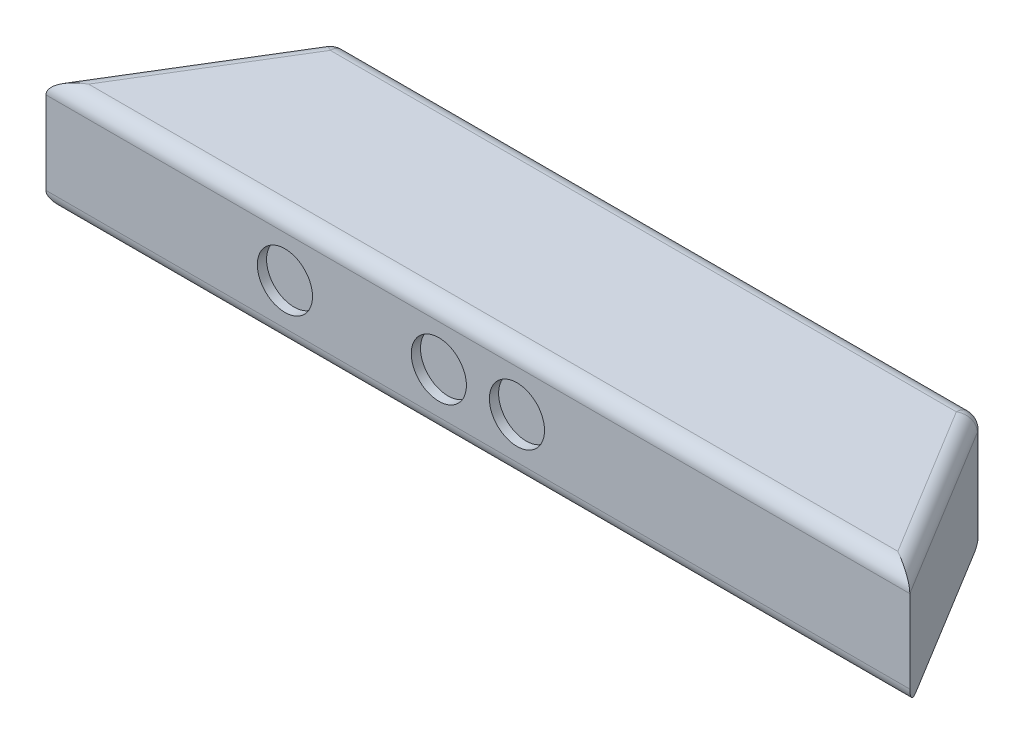
ISO-10303-21;
HEADER;
FILE_DESCRIPTION(('STEP AP214'),'2;1');
FILE_NAME('part.step','',(''),(''),'','','');
FILE_SCHEMA(('AUTOMOTIVE_DESIGN { 1 0 10303 214 1 1 1 1 }'));
ENDSEC;
DATA;
#1=APPLICATION_CONTEXT('core data for automotive mechanical design processes');
#2=APPLICATION_PROTOCOL_DEFINITION('international standard','automotive_design',2000,#1);
#3=PRODUCT_CONTEXT('',#1,'mechanical');
#4=PRODUCT('Part','Part','',(#3));
#5=PRODUCT_RELATED_PRODUCT_CATEGORY('part','',(#4));
#6=PRODUCT_DEFINITION_FORMATION('','',#4);
#7=PRODUCT_DEFINITION_CONTEXT('part definition',#1,'design');
#8=PRODUCT_DEFINITION('design','',#6,#7);
#9=PRODUCT_DEFINITION_SHAPE('','',#8);
#10=(LENGTH_UNIT() NAMED_UNIT(*) SI_UNIT(.MILLI.,.METRE.));
#11=(NAMED_UNIT(*) PLANE_ANGLE_UNIT() SI_UNIT($,.RADIAN.));
#12=(NAMED_UNIT(*) SI_UNIT($,.STERADIAN.) SOLID_ANGLE_UNIT());
#13=UNCERTAINTY_MEASURE_WITH_UNIT(LENGTH_MEASURE(1.E-05),#10,'distance_accuracy_value','');
#14=(GEOMETRIC_REPRESENTATION_CONTEXT(3) GLOBAL_UNCERTAINTY_ASSIGNED_CONTEXT((#13)) GLOBAL_UNIT_ASSIGNED_CONTEXT((#10,
#11,#12)) REPRESENTATION_CONTEXT('',''));
#15=CARTESIAN_POINT('',(0.,0.,0.));
#16=DIRECTION('',(0.,0.,1.));
#17=DIRECTION('',(1.,0.,0.));
#18=AXIS2_PLACEMENT_3D('',#15,#16,#17);
#19=CARTESIAN_POINT('',(-102.193572476058,-18.5,4.99999999999999));
#20=DIRECTION('',(0.,-1.,0.));
#21=DIRECTION('',(1.,0.,0.));
#22=AXIS2_PLACEMENT_3D('',#19,#20,#21);
#23=PLANE('',#22);
#24=DIRECTION('',(-0.52086464562913,0.,0.85363928033663));
#25=VECTOR('',#24,1.);
#26=CARTESIAN_POINT('',(-136.731803598317,-18.5,61.6043232281456));
#27=LINE('',#26,#25);
#28=CARTESIAN_POINT('',(-132.091877560804,-18.5,54.));
#29=VERTEX_POINT('',#28);
#30=CARTESIAN_POINT('',(-102.193572476058,-18.5,4.99999999999999));
#31=VERTEX_POINT('',#30);
#32=EDGE_CURVE('E179',#29,#31,#27,.F.);
#33=ORIENTED_EDGE('',*,*,#32,.T.);
#34=DIRECTION('',(1.,0.,0.));
#35=VECTOR('',#34,1.);
#36=CARTESIAN_POINT('',(-141.,-18.5,5.));
#37=LINE('',#36,#35);
#38=CARTESIAN_POINT('',(108.050847457627,-18.5,4.99999999999999));
#39=VERTEX_POINT('',#38);
#40=EDGE_CURVE('E53',#31,#39,#37,.T.);
#41=ORIENTED_EDGE('',*,*,#40,.T.);
#42=DIRECTION('',(-0.520864645629131,0.,-0.853639280336631));
#43=VECTOR('',#42,1.);
#44=CARTESIAN_POINT('',(141.,-18.5,59.));
#45=LINE('',#44,#43);
#46=CARTESIAN_POINT('',(137.949152542373,-18.5,54.));
#47=VERTEX_POINT('',#46);
#48=EDGE_CURVE('E33',#47,#39,#45,.T.);
#49=ORIENTED_EDGE('',*,*,#48,.F.);
#50=DIRECTION('',(1.,0.,0.));
#51=VECTOR('',#50,1.);
#52=CARTESIAN_POINT('',(-141.,-18.5,54.));
#53=LINE('',#52,#51);
#54=EDGE_CURVE('E181',#47,#29,#53,.F.);
#55=ORIENTED_EDGE('',*,*,#54,.T.);
#56=EDGE_LOOP('',(#33,#41,#49,#55));
#57=FACE_BOUND('',#56,.T.);
#58=ADVANCED_FACE('F30',(#57),#23,.T.);
#59=CARTESIAN_POINT('',(-141.,18.5,59.));
#60=DIRECTION('',(0.,-1.,0.));
#61=DIRECTION('',(0.,0.,-1.));
#62=AXIS2_PLACEMENT_3D('',#59,#60,#61);
#63=PLANE('',#62);
#64=DIRECTION('',(-1.,0.,0.));
#65=VECTOR('',#64,1.);
#66=CARTESIAN_POINT('',(141.,18.5,54.));
#67=LINE('',#66,#65);
#68=CARTESIAN_POINT('',(-132.091877560804,18.5,54.));
#69=VERTEX_POINT('',#68);
#70=CARTESIAN_POINT('',(132.091877560804,18.5,54.));
#71=VERTEX_POINT('',#70);
#72=EDGE_CURVE('E190',#69,#71,#67,.F.);
#73=ORIENTED_EDGE('',*,*,#72,.T.);
#74=DIRECTION('',(0.520864645629131,0.,0.853639280336631));
#75=VECTOR('',#74,1.);
#76=CARTESIAN_POINT('',(60.2252095016034,18.5,-63.7814837636902));
#77=LINE('',#76,#75);
#78=CARTESIAN_POINT('',(102.193572476058,18.5,5.));
#79=VERTEX_POINT('',#78);
#80=EDGE_CURVE('E183',#71,#79,#77,.F.);
#81=ORIENTED_EDGE('',*,*,#80,.T.);
#82=DIRECTION('',(-1.,0.,0.));
#83=VECTOR('',#82,1.);
#84=CARTESIAN_POINT('',(-141.,18.5,5.));
#85=LINE('',#84,#83);
#86=CARTESIAN_POINT('',(-102.193572476058,18.5,5.));
#87=VERTEX_POINT('',#86);
#88=EDGE_CURVE('E186',#79,#87,#85,.T.);
#89=ORIENTED_EDGE('',*,*,#88,.T.);
#90=DIRECTION('',(0.52086464562913,0.,-0.85363928033663));
#91=VECTOR('',#90,1.);
#92=CARTESIAN_POINT('',(-136.731803598317,18.5,61.6043232281457));
#93=LINE('',#92,#91);
#94=EDGE_CURVE('E188',#87,#69,#93,.F.);
#95=ORIENTED_EDGE('',*,*,#94,.T.);
#96=EDGE_LOOP('',(#73,#81,#89,#95));
#97=FACE_BOUND('',#96,.T.);
#98=ADVANCED_FACE('F236',(#97),#63,.F.);
#99=CARTESIAN_POINT('',(-141.,-18.5,59.));
#100=DIRECTION('',(0.,0.,1.));
#101=DIRECTION('',(1.,0.,0.));
#102=AXIS2_PLACEMENT_3D('',#99,#100,#101);
#103=PLANE('',#102);
#104=CARTESIAN_POINT('',(12.75,0.,59.));
#105=DIRECTION('',(0.,0.,1.));
#106=DIRECTION('',(1.,0.,0.));
#107=AXIS2_PLACEMENT_3D('',#104,#105,#106);
#108=CIRCLE('',#107,9.);
#109=CARTESIAN_POINT('',(21.75,0.,59.));
#110=VERTEX_POINT('',#109);
#111=EDGE_CURVE('E218',#110,#110,#108,.T.);
#112=ORIENTED_EDGE('',*,*,#111,.F.);
#113=EDGE_LOOP('',(#112));
#114=FACE_BOUND('',#113,.T.);
#115=CARTESIAN_POINT('',(-12.75,0.,59.));
#116=DIRECTION('',(0.,0.,1.));
#117=DIRECTION('',(1.,0.,0.));
#118=AXIS2_PLACEMENT_3D('',#115,#116,#117);
#119=CIRCLE('',#118,9.);
#120=CARTESIAN_POINT('',(-3.75,0.,59.));
#121=VERTEX_POINT('',#120);
#122=EDGE_CURVE('E212',#121,#121,#119,.T.);
#123=ORIENTED_EDGE('',*,*,#122,.F.);
#124=EDGE_LOOP('',(#123));
#125=FACE_BOUND('',#124,.T.);
#126=CARTESIAN_POINT('',(-63.,0.,59.));
#127=DIRECTION('',(0.,0.,1.));
#128=DIRECTION('',(1.,0.,0.));
#129=AXIS2_PLACEMENT_3D('',#126,#127,#128);
#130=CIRCLE('',#129,9.);
#131=CARTESIAN_POINT('',(-54.,0.,59.));
#132=VERTEX_POINT('',#131);
#133=EDGE_CURVE('E206',#132,#132,#130,.T.);
#134=ORIENTED_EDGE('',*,*,#133,.F.);
#135=EDGE_LOOP('',(#134));
#136=FACE_BOUND('',#135,.T.);
#137=DIRECTION('',(0.,-1.,0.));
#138=VECTOR('',#137,1.);
#139=CARTESIAN_POINT('',(-141.,18.5,59.));
#140=LINE('',#139,#138);
#141=CARTESIAN_POINT('',(-141.,13.5,59.));
#142=VERTEX_POINT('',#141);
#143=CARTESIAN_POINT('',(-141.,-13.5,59.));
#144=VERTEX_POINT('',#143);
#145=EDGE_CURVE('E203',#142,#144,#140,.T.);
#146=ORIENTED_EDGE('',*,*,#145,.T.);
#147=DIRECTION('',(1.,0.,0.));
#148=VECTOR('',#147,1.);
#149=CARTESIAN_POINT('',(141.,-13.5,59.));
#150=LINE('',#149,#148);
#151=CARTESIAN_POINT('',(141.,-13.5,59.));
#152=VERTEX_POINT('',#151);
#153=EDGE_CURVE('E166',#144,#152,#150,.T.);
#154=ORIENTED_EDGE('',*,*,#153,.T.);
#155=DIRECTION('',(0.,1.,0.));
#156=VECTOR('',#155,1.);
#157=CARTESIAN_POINT('',(141.,18.5,59.));
#158=LINE('',#157,#156);
#159=CARTESIAN_POINT('',(141.,13.5,59.));
#160=VERTEX_POINT('',#159);
#161=EDGE_CURVE('E200',#152,#160,#158,.T.);
#162=ORIENTED_EDGE('',*,*,#161,.T.);
#163=DIRECTION('',(-1.,0.,0.));
#164=VECTOR('',#163,1.);
#165=CARTESIAN_POINT('',(-141.,13.5,59.));
#166=LINE('',#165,#164);
#167=EDGE_CURVE('E130',#160,#142,#166,.T.);
#168=ORIENTED_EDGE('',*,*,#167,.T.);
#169=EDGE_LOOP('',(#146,#154,#162,#168));
#170=FACE_BOUND('',#169,.T.);
#171=ADVANCED_FACE('F232',(#114,#125,#136,#170),#103,.T.);
#172=CARTESIAN_POINT('',(-141.,-18.5,0.));
#173=DIRECTION('',(0.,0.,1.));
#174=DIRECTION('',(1.,0.,0.));
#175=AXIS2_PLACEMENT_3D('',#172,#173,#174);
#176=PLANE('',#175);
#177=DIRECTION('',(0.,1.,0.));
#178=VECTOR('',#177,1.);
#179=CARTESIAN_POINT('',(102.193572476058,-18.5,0.));
#180=LINE('',#179,#178);
#181=CARTESIAN_POINT('',(102.193572476058,13.5,0.));
#182=VERTEX_POINT('',#181);
#183=CARTESIAN_POINT('',(102.193572476058,-13.5,0.));
#184=VERTEX_POINT('',#183);
#185=EDGE_CURVE('E173',#182,#184,#180,.F.);
#186=ORIENTED_EDGE('',*,*,#185,.T.);
#187=DIRECTION('',(1.,0.,0.));
#188=VECTOR('',#187,1.);
#189=CARTESIAN_POINT('',(-141.,-13.5,0.));
#190=LINE('',#189,#188);
#191=CARTESIAN_POINT('',(-102.193572476058,-13.5,0.));
#192=VERTEX_POINT('',#191);
#193=EDGE_CURVE('E170',#184,#192,#190,.F.);
#194=ORIENTED_EDGE('',*,*,#193,.T.);
#195=DIRECTION('',(0.,1.,0.));
#196=VECTOR('',#195,1.);
#197=CARTESIAN_POINT('',(-102.193572476058,-18.5,0.));
#198=LINE('',#197,#196);
#199=CARTESIAN_POINT('',(-102.193572476058,13.5,0.));
#200=VERTEX_POINT('',#199);
#201=EDGE_CURVE('E140',#192,#200,#198,.T.);
#202=ORIENTED_EDGE('',*,*,#201,.T.);
#203=DIRECTION('',(-1.,0.,0.));
#204=VECTOR('',#203,1.);
#205=CARTESIAN_POINT('',(-141.,13.5,0.));
#206=LINE('',#205,#204);
#207=EDGE_CURVE('E175',#200,#182,#206,.F.);
#208=ORIENTED_EDGE('',*,*,#207,.T.);
#209=EDGE_LOOP('',(#186,#194,#202,#208));
#210=FACE_BOUND('',#209,.T.);
#211=ADVANCED_FACE('F235',(#210),#176,.F.);
#212=CARTESIAN_POINT('',(-63.,0.,56.));
#213=DIRECTION('',(0.,0.,1.));
#214=DIRECTION('',(1.,0.,0.));
#215=AXIS2_PLACEMENT_3D('',#212,#213,#214);
#216=CYLINDRICAL_SURFACE('',#215,9.);
#217=CARTESIAN_POINT('',(-63.,0.,56.));
#218=DIRECTION('',(0.,0.,1.));
#219=DIRECTION('',(1.,0.,0.));
#220=AXIS2_PLACEMENT_3D('',#217,#218,#219);
#221=CIRCLE('',#220,9.);
#222=CARTESIAN_POINT('',(-54.,0.,56.));
#223=VERTEX_POINT('',#222);
#224=EDGE_CURVE('E205',#223,#223,#221,.T.);
#225=ORIENTED_EDGE('',*,*,#224,.F.);
#226=EDGE_LOOP('',(#225));
#227=FACE_BOUND('',#226,.T.);
#228=ORIENTED_EDGE('',*,*,#133,.T.);
#229=EDGE_LOOP('',(#228));
#230=FACE_BOUND('',#229,.T.);
#231=ADVANCED_FACE('F282',(#227,#230),#216,.F.);
#232=CARTESIAN_POINT('',(-63.,0.,56.));
#233=DIRECTION('',(0.,0.,1.));
#234=DIRECTION('',(1.,0.,0.));
#235=AXIS2_PLACEMENT_3D('',#232,#233,#234);
#236=PLANE('',#235);
#237=ORIENTED_EDGE('',*,*,#224,.T.);
#238=EDGE_LOOP('',(#237));
#239=FACE_BOUND('',#238,.T.);
#240=ADVANCED_FACE('F287',(#239),#236,.T.);
#241=CARTESIAN_POINT('',(-12.75,0.,56.));
#242=DIRECTION('',(0.,0.,1.));
#243=DIRECTION('',(1.,0.,0.));
#244=AXIS2_PLACEMENT_3D('',#241,#242,#243);
#245=CYLINDRICAL_SURFACE('',#244,9.);
#246=CARTESIAN_POINT('',(-12.75,0.,56.));
#247=DIRECTION('',(0.,0.,1.));
#248=DIRECTION('',(1.,0.,0.));
#249=AXIS2_PLACEMENT_3D('',#246,#247,#248);
#250=CIRCLE('',#249,9.);
#251=CARTESIAN_POINT('',(-3.75,0.,56.));
#252=VERTEX_POINT('',#251);
#253=EDGE_CURVE('E209',#252,#252,#250,.T.);
#254=ORIENTED_EDGE('',*,*,#253,.F.);
#255=EDGE_LOOP('',(#254));
#256=FACE_BOUND('',#255,.T.);
#257=ORIENTED_EDGE('',*,*,#122,.T.);
#258=EDGE_LOOP('',(#257));
#259=FACE_BOUND('',#258,.T.);
#260=ADVANCED_FACE('F334',(#256,#259),#245,.F.);
#261=CARTESIAN_POINT('',(-12.75,0.,56.));
#262=DIRECTION('',(0.,0.,1.));
#263=DIRECTION('',(1.,0.,0.));
#264=AXIS2_PLACEMENT_3D('',#261,#262,#263);
#265=PLANE('',#264);
#266=ORIENTED_EDGE('',*,*,#253,.T.);
#267=EDGE_LOOP('',(#266));
#268=FACE_BOUND('',#267,.T.);
#269=ADVANCED_FACE('F228',(#268),#265,.T.);
#270=CARTESIAN_POINT('',(12.75,0.,56.));
#271=DIRECTION('',(0.,0.,1.));
#272=DIRECTION('',(1.,0.,0.));
#273=AXIS2_PLACEMENT_3D('',#270,#271,#272);
#274=CYLINDRICAL_SURFACE('',#273,9.);
#275=CARTESIAN_POINT('',(12.75,0.,56.));
#276=DIRECTION('',(0.,0.,1.));
#277=DIRECTION('',(1.,0.,0.));
#278=AXIS2_PLACEMENT_3D('',#275,#276,#277);
#279=CIRCLE('',#278,9.);
#280=CARTESIAN_POINT('',(21.75,0.,56.));
#281=VERTEX_POINT('',#280);
#282=EDGE_CURVE('E215',#281,#281,#279,.T.);
#283=ORIENTED_EDGE('',*,*,#282,.F.);
#284=EDGE_LOOP('',(#283));
#285=FACE_BOUND('',#284,.T.);
#286=ORIENTED_EDGE('',*,*,#111,.T.);
#287=EDGE_LOOP('',(#286));
#288=FACE_BOUND('',#287,.T.);
#289=ADVANCED_FACE('F225',(#285,#288),#274,.F.);
#290=CARTESIAN_POINT('',(12.75,0.,56.));
#291=DIRECTION('',(0.,0.,1.));
#292=DIRECTION('',(1.,0.,0.));
#293=AXIS2_PLACEMENT_3D('',#290,#291,#292);
#294=PLANE('',#293);
#295=ORIENTED_EDGE('',*,*,#282,.T.);
#296=EDGE_LOOP('',(#295));
#297=FACE_BOUND('',#296,.T.);
#298=ADVANCED_FACE('F223',(#297),#294,.T.);
#299=CARTESIAN_POINT('',(-105.,-87.6158447825099,0.));
#300=DIRECTION('',(0.85363928033663,0.,0.52086464562913));
#301=DIRECTION('',(0.52086464562913,0.,-0.85363928033663));
#302=AXIS2_PLACEMENT_3D('',#299,#300,#301);
#303=PLANE('',#302);
#304=DIRECTION('',(0.,1.,0.));
#305=VECTOR('',#304,1.);
#306=CARTESIAN_POINT('',(-106.461768877742,-87.6158447825099,2.39567677185435));
#307=LINE('',#306,#305);
#308=CARTESIAN_POINT('',(-106.461768877742,13.5,2.39567677185436));
#309=VERTEX_POINT('',#308);
#310=CARTESIAN_POINT('',(-106.461768877742,-13.5,2.39567677185435));
#311=VERTEX_POINT('',#310);
#312=EDGE_CURVE('E107',#309,#311,#307,.F.);
#313=ORIENTED_EDGE('',*,*,#312,.T.);
#314=DIRECTION('',(-0.52086464562913,0.,0.85363928033663));
#315=VECTOR('',#314,1.);
#316=CARTESIAN_POINT('',(-105.,-13.5,0.));
#317=LINE('',#316,#315);
#318=EDGE_CURVE('E111',#311,#144,#317,.T.);
#319=ORIENTED_EDGE('',*,*,#318,.T.);
#320=ORIENTED_EDGE('',*,*,#145,.F.);
#321=DIRECTION('',(0.52086464562913,0.,-0.85363928033663));
#322=VECTOR('',#321,1.);
#323=CARTESIAN_POINT('',(-105.,13.5,0.));
#324=LINE('',#323,#322);
#325=EDGE_CURVE('E114',#142,#309,#324,.T.);
#326=ORIENTED_EDGE('',*,*,#325,.T.);
#327=EDGE_LOOP('',(#313,#319,#320,#326));
#328=FACE_BOUND('',#327,.T.);
#329=ADVANCED_FACE('F109',(#328),#303,.F.);
#330=CARTESIAN_POINT('',(141.,-87.6158447825099,59.));
#331=DIRECTION('',(-0.853639280336631,0.,0.520864645629131));
#332=DIRECTION('',(0.520864645629131,0.,0.853639280336631));
#333=AXIS2_PLACEMENT_3D('',#330,#331,#332);
#334=PLANE('',#333);
#335=DIRECTION('',(0.,1.,0.));
#336=VECTOR('',#335,1.);
#337=CARTESIAN_POINT('',(106.461768877742,-87.6158447825099,2.39567677185434));
#338=LINE('',#337,#336);
#339=CARTESIAN_POINT('',(106.461768877742,-17.7681964016831,2.39567677185434));
#340=VERTEX_POINT('',#339);
#341=CARTESIAN_POINT('',(106.461768877742,13.5,2.39567677185434));
#342=VERTEX_POINT('',#341);
#343=EDGE_CURVE('E197',#340,#342,#338,.T.);
#344=ORIENTED_EDGE('',*,*,#343,.T.);
#345=DIRECTION('',(0.520864645629131,0.,0.853639280336631));
#346=VECTOR('',#345,1.);
#347=CARTESIAN_POINT('',(141.,13.5,59.));
#348=LINE('',#347,#346);
#349=EDGE_CURVE('E192',#342,#160,#348,.T.);
#350=ORIENTED_EDGE('',*,*,#349,.T.);
#351=ORIENTED_EDGE('',*,*,#161,.F.);
#352=CARTESIAN_POINT('',(137.949152542373,-13.5,54.));
#353=DIRECTION('',(-0.853639280336631,0.,0.520864645629131));
#354=DIRECTION('',(-0.520864645629131,0.,-0.853639280336631));
#355=AXIS2_PLACEMENT_3D('',#352,#353,#354);
#356=ELLIPSE('',#355,5.85727498156863,5.);
#357=EDGE_CURVE('E46',#152,#47,#356,.F.);
#358=ORIENTED_EDGE('',*,*,#357,.T.);
#359=ORIENTED_EDGE('',*,*,#48,.T.);
#360=CARTESIAN_POINT('',(108.050847457627,-13.5,5.));
#361=DIRECTION('',(-0.853639280336631,0.,0.520864645629131));
#362=DIRECTION('',(0.520864645629131,0.,0.853639280336631));
#363=AXIS2_PLACEMENT_3D('',#360,#361,#362);
#364=ELLIPSE('',#363,5.85727498156863,5.);
#365=EDGE_CURVE('E195',#39,#340,#364,.F.);
#366=ORIENTED_EDGE('',*,*,#365,.T.);
#367=EDGE_LOOP('',(#344,#350,#351,#358,#359,#366));
#368=FACE_BOUND('',#367,.T.);
#369=ADVANCED_FACE('F248',(#368),#334,.F.);
#370=CARTESIAN_POINT('',(-141.,-13.5,54.));
#371=DIRECTION('',(-1.,0.,0.));
#372=DIRECTION('',(0.,-1.,0.));
#373=AXIS2_PLACEMENT_3D('',#370,#371,#372);
#374=CYLINDRICAL_SURFACE('',#373,5.);
#375=ORIENTED_EDGE('',*,*,#357,.F.);
#376=ORIENTED_EDGE('',*,*,#153,.F.);
#377=CARTESIAN_POINT('',(-132.091877560804,-13.5,54.));
#378=DIRECTION('',(-0.489456512047224,0.,-0.872027707595673));
#379=DIRECTION('',(-0.872027707595673,0.,0.489456512047224));
#380=AXIS2_PLACEMENT_3D('',#377,#378,#379);
#381=ELLIPSE('',#380,10.2154121498696,5.);
#382=EDGE_CURVE('E129',#29,#144,#381,.T.);
#383=ORIENTED_EDGE('',*,*,#382,.F.);
#384=ORIENTED_EDGE('',*,*,#54,.F.);
#385=EDGE_LOOP('',(#375,#376,#383,#384));
#386=FACE_BOUND('',#385,.T.);
#387=ADVANCED_FACE('F245',(#386),#374,.T.);
#388=CARTESIAN_POINT('',(-100.731803598317,-13.5,2.60432322814565));
#389=DIRECTION('',(-0.52086464562913,0.,0.85363928033663));
#390=DIRECTION('',(0.85363928033663,0.,0.52086464562913));
#391=AXIS2_PLACEMENT_3D('',#388,#389,#390);
#392=CYLINDRICAL_SURFACE('',#391,5.);
#393=CARTESIAN_POINT('',(-102.193572476058,-13.5,4.99999999999999));
#394=DIRECTION('',(0.520864645629128,0.,-0.853639280336632));
#395=DIRECTION('',(-0.853639280336632,0.,-0.520864645629128));
#396=AXIS2_PLACEMENT_3D('',#393,#394,#395);
#397=CIRCLE('',#396,5.);
#398=EDGE_CURVE('E126',#31,#311,#397,.T.);
#399=ORIENTED_EDGE('',*,*,#398,.F.);
#400=ORIENTED_EDGE('',*,*,#32,.F.);
#401=ORIENTED_EDGE('',*,*,#382,.T.);
#402=ORIENTED_EDGE('',*,*,#318,.F.);
#403=EDGE_LOOP('',(#399,#400,#401,#402));
#404=FACE_BOUND('',#403,.T.);
#405=ADVANCED_FACE('F124',(#404),#392,.T.);
#406=CARTESIAN_POINT('',(-102.193572476058,-13.5,5.));
#407=DIRECTION('',(0.,0.,1.));
#408=DIRECTION('',(1.,0.,0.));
#409=AXIS2_PLACEMENT_3D('',#406,#407,#408);
#410=SPHERICAL_SURFACE('',#409,5.);
#411=CARTESIAN_POINT('',(-102.193572476058,-13.5,5.));
#412=DIRECTION('',(-1.,0.,0.));
#413=DIRECTION('',(0.,-1.,0.));
#414=AXIS2_PLACEMENT_3D('',#411,#412,#413);
#415=CIRCLE('',#414,5.);
#416=EDGE_CURVE('E137',#31,#192,#415,.F.);
#417=ORIENTED_EDGE('',*,*,#416,.F.);
#418=ORIENTED_EDGE('',*,*,#398,.T.);
#419=CARTESIAN_POINT('',(-102.193572476058,-13.5,5.00000000000001));
#420=DIRECTION('',(0.,-1.,0.));
#421=DIRECTION('',(0.,0.,-1.));
#422=AXIS2_PLACEMENT_3D('',#419,#420,#421);
#423=CIRCLE('',#422,5.);
#424=EDGE_CURVE('E135',#192,#311,#423,.F.);
#425=ORIENTED_EDGE('',*,*,#424,.F.);
#426=EDGE_LOOP('',(#417,#418,#425));
#427=FACE_BOUND('',#426,.T.);
#428=ADVANCED_FACE('F134',(#427),#410,.T.);
#429=CARTESIAN_POINT('',(-102.193572476058,-18.5,5.));
#430=DIRECTION('',(0.,1.,0.));
#431=DIRECTION('',(0.,0.,1.));
#432=AXIS2_PLACEMENT_3D('',#429,#430,#431);
#433=CYLINDRICAL_SURFACE('',#432,5.);
#434=ORIENTED_EDGE('',*,*,#424,.T.);
#435=ORIENTED_EDGE('',*,*,#312,.F.);
#436=CARTESIAN_POINT('',(-102.193572476058,13.5,5.));
#437=DIRECTION('',(0.,1.,0.));
#438=DIRECTION('',(-1.,0.,0.));
#439=AXIS2_PLACEMENT_3D('',#436,#437,#438);
#440=CIRCLE('',#439,5.);
#441=EDGE_CURVE('E142',#200,#309,#440,.T.);
#442=ORIENTED_EDGE('',*,*,#441,.F.);
#443=ORIENTED_EDGE('',*,*,#201,.F.);
#444=EDGE_LOOP('',(#434,#435,#442,#443));
#445=FACE_BOUND('',#444,.T.);
#446=ADVANCED_FACE('F139',(#445),#433,.T.);
#447=CARTESIAN_POINT('',(-141.,-13.5,5.));
#448=DIRECTION('',(1.,0.,0.));
#449=DIRECTION('',(0.,1.,0.));
#450=AXIS2_PLACEMENT_3D('',#447,#448,#449);
#451=CYLINDRICAL_SURFACE('',#450,5.);
#452=ORIENTED_EDGE('',*,*,#416,.T.);
#453=ORIENTED_EDGE('',*,*,#193,.F.);
#454=CARTESIAN_POINT('',(102.193572476058,-13.5,5.));
#455=DIRECTION('',(0.707106781186548,0.707106781186547,0.));
#456=DIRECTION('',(-0.707106781186548,0.707106781186547,0.));
#457=AXIS2_PLACEMENT_3D('',#454,#455,#456);
#458=ELLIPSE('',#457,7.07106781186547,5.);
#459=EDGE_CURVE('E150',#340,#184,#458,.T.);
#460=ORIENTED_EDGE('',*,*,#459,.F.);
#461=ORIENTED_EDGE('',*,*,#365,.F.);
#462=ORIENTED_EDGE('',*,*,#40,.F.);
#463=EDGE_LOOP('',(#452,#453,#460,#461,#462));
#464=FACE_BOUND('',#463,.T.);
#465=ADVANCED_FACE('F251',(#464),#451,.T.);
#466=CARTESIAN_POINT('',(-102.193572476058,13.5,5.));
#467=DIRECTION('',(0.,0.,1.));
#468=DIRECTION('',(1.,0.,0.));
#469=AXIS2_PLACEMENT_3D('',#466,#467,#468);
#470=SPHERICAL_SURFACE('',#469,5.);
#471=CARTESIAN_POINT('',(-102.193572476058,13.5,5.00000000000001));
#472=DIRECTION('',(0.520864645629131,0.,-0.85363928033663));
#473=DIRECTION('',(-0.85363928033663,0.,-0.520864645629131));
#474=AXIS2_PLACEMENT_3D('',#471,#472,#473);
#475=CIRCLE('',#474,5.);
#476=EDGE_CURVE('E153',#87,#309,#475,.F.);
#477=ORIENTED_EDGE('',*,*,#476,.F.);
#478=CARTESIAN_POINT('',(-102.193572476058,13.5,5.));
#479=DIRECTION('',(-1.,0.,0.));
#480=DIRECTION('',(0.,0.,1.));
#481=AXIS2_PLACEMENT_3D('',#478,#479,#480);
#482=CIRCLE('',#481,5.);
#483=EDGE_CURVE('E147',#200,#87,#482,.F.);
#484=ORIENTED_EDGE('',*,*,#483,.F.);
#485=ORIENTED_EDGE('',*,*,#441,.T.);
#486=EDGE_LOOP('',(#477,#484,#485));
#487=FACE_BOUND('',#486,.T.);
#488=ADVANCED_FACE('F274',(#487),#470,.T.);
#489=CARTESIAN_POINT('',(-141.,13.5,5.));
#490=DIRECTION('',(-1.,0.,0.));
#491=DIRECTION('',(0.,0.,1.));
#492=AXIS2_PLACEMENT_3D('',#489,#490,#491);
#493=CYLINDRICAL_SURFACE('',#492,5.);
#494=ORIENTED_EDGE('',*,*,#483,.T.);
#495=ORIENTED_EDGE('',*,*,#88,.F.);
#496=CARTESIAN_POINT('',(102.193572476058,13.5,5.));
#497=DIRECTION('',(1.,0.,0.));
#498=DIRECTION('',(0.,1.,0.));
#499=AXIS2_PLACEMENT_3D('',#496,#497,#498);
#500=CIRCLE('',#499,5.);
#501=EDGE_CURVE('E156',#182,#79,#500,.T.);
#502=ORIENTED_EDGE('',*,*,#501,.F.);
#503=ORIENTED_EDGE('',*,*,#207,.F.);
#504=EDGE_LOOP('',(#494,#495,#502,#503));
#505=FACE_BOUND('',#504,.T.);
#506=ADVANCED_FACE('F279',(#505),#493,.T.);
#507=CARTESIAN_POINT('',(102.193572476058,-87.6158447825099,5.));
#508=DIRECTION('',(0.,1.,0.));
#509=DIRECTION('',(0.,0.,1.));
#510=AXIS2_PLACEMENT_3D('',#507,#508,#509);
#511=CYLINDRICAL_SURFACE('',#510,5.);
#512=ORIENTED_EDGE('',*,*,#459,.T.);
#513=ORIENTED_EDGE('',*,*,#185,.F.);
#514=CARTESIAN_POINT('',(102.193572476058,13.5,4.99999999999999));
#515=DIRECTION('',(0.,1.,0.));
#516=DIRECTION('',(0.,0.,1.));
#517=AXIS2_PLACEMENT_3D('',#514,#515,#516);
#518=CIRCLE('',#517,5.);
#519=EDGE_CURVE('E159',#342,#182,#518,.T.);
#520=ORIENTED_EDGE('',*,*,#519,.F.);
#521=ORIENTED_EDGE('',*,*,#343,.F.);
#522=EDGE_LOOP('',(#512,#513,#520,#521));
#523=FACE_BOUND('',#522,.T.);
#524=ADVANCED_FACE('F257',(#523),#511,.T.);
#525=CARTESIAN_POINT('',(-100.731803598317,13.5,2.60432322814565));
#526=DIRECTION('',(0.52086464562913,0.,-0.85363928033663));
#527=DIRECTION('',(-0.85363928033663,0.,-0.52086464562913));
#528=AXIS2_PLACEMENT_3D('',#525,#526,#527);
#529=CYLINDRICAL_SURFACE('',#528,5.);
#530=ORIENTED_EDGE('',*,*,#476,.T.);
#531=ORIENTED_EDGE('',*,*,#325,.F.);
#532=CARTESIAN_POINT('',(-132.091877560804,13.5,54.));
#533=DIRECTION('',(0.489456512047224,0.,0.872027707595673));
#534=DIRECTION('',(0.872027707595673,0.,-0.489456512047224));
#535=AXIS2_PLACEMENT_3D('',#532,#533,#534);
#536=ELLIPSE('',#535,10.2154121498696,5.);
#537=EDGE_CURVE('E162',#69,#142,#536,.T.);
#538=ORIENTED_EDGE('',*,*,#537,.F.);
#539=ORIENTED_EDGE('',*,*,#94,.F.);
#540=EDGE_LOOP('',(#530,#531,#538,#539));
#541=FACE_BOUND('',#540,.T.);
#542=ADVANCED_FACE('F270',(#541),#529,.T.);
#543=CARTESIAN_POINT('',(102.193572476058,13.5,5.));
#544=DIRECTION('',(0.,0.,1.));
#545=DIRECTION('',(1.,0.,0.));
#546=AXIS2_PLACEMENT_3D('',#543,#544,#545);
#547=SPHERICAL_SURFACE('',#546,5.);
#548=ORIENTED_EDGE('',*,*,#519,.T.);
#549=ORIENTED_EDGE('',*,*,#501,.T.);
#550=CARTESIAN_POINT('',(102.193572476058,13.5,5.));
#551=DIRECTION('',(-0.520864645629132,0.,-0.85363928033663));
#552=DIRECTION('',(-0.85363928033663,0.,0.520864645629132));
#553=AXIS2_PLACEMENT_3D('',#550,#551,#552);
#554=CIRCLE('',#553,5.);
#555=EDGE_CURVE('E38',#342,#79,#554,.F.);
#556=ORIENTED_EDGE('',*,*,#555,.F.);
#557=EDGE_LOOP('',(#548,#549,#556));
#558=FACE_BOUND('',#557,.T.);
#559=ADVANCED_FACE('F301',(#558),#547,.T.);
#560=CARTESIAN_POINT('',(-141.,13.5,54.));
#561=DIRECTION('',(1.,0.,0.));
#562=DIRECTION('',(0.,0.,-1.));
#563=AXIS2_PLACEMENT_3D('',#560,#561,#562);
#564=CYLINDRICAL_SURFACE('',#563,5.);
#565=ORIENTED_EDGE('',*,*,#537,.T.);
#566=ORIENTED_EDGE('',*,*,#167,.F.);
#567=CARTESIAN_POINT('',(132.091877560804,13.5,54.));
#568=DIRECTION('',(0.489456512047224,0.,-0.872027707595673));
#569=DIRECTION('',(0.872027707595673,0.,0.489456512047224));
#570=AXIS2_PLACEMENT_3D('',#567,#568,#569);
#571=ELLIPSE('',#570,10.2154121498696,5.);
#572=EDGE_CURVE('E11',#71,#160,#571,.T.);
#573=ORIENTED_EDGE('',*,*,#572,.F.);
#574=ORIENTED_EDGE('',*,*,#72,.F.);
#575=EDGE_LOOP('',(#565,#566,#573,#574));
#576=FACE_BOUND('',#575,.T.);
#577=ADVANCED_FACE('F266',(#576),#564,.T.);
#578=CARTESIAN_POINT('',(136.731803598317,13.5,61.6043232281457));
#579=DIRECTION('',(0.520864645629131,0.,0.853639280336631));
#580=DIRECTION('',(0.853639280336631,0.,-0.520864645629131));
#581=AXIS2_PLACEMENT_3D('',#578,#579,#580);
#582=CYLINDRICAL_SURFACE('',#581,5.);
#583=ORIENTED_EDGE('',*,*,#555,.T.);
#584=ORIENTED_EDGE('',*,*,#80,.F.);
#585=ORIENTED_EDGE('',*,*,#572,.T.);
#586=ORIENTED_EDGE('',*,*,#349,.F.);
#587=EDGE_LOOP('',(#583,#584,#585,#586));
#588=FACE_BOUND('',#587,.T.);
#589=ADVANCED_FACE('F261',(#588),#582,.T.);
#590=CLOSED_SHELL('',(#58,#98,#171,#211,#231,#240,#260,#269,#289,#298,#329,#369,#387,#405,#428,
#446,#465,#488,#506,#524,#542,#559,#577,#589));
#591=MANIFOLD_SOLID_BREP('B2',#590);
#592=ADVANCED_BREP_SHAPE_REPRESENTATION('',(#18,#591),#14);
#593=SHAPE_DEFINITION_REPRESENTATION(#9,#592);
ENDSEC;
END-ISO-10303-21;
